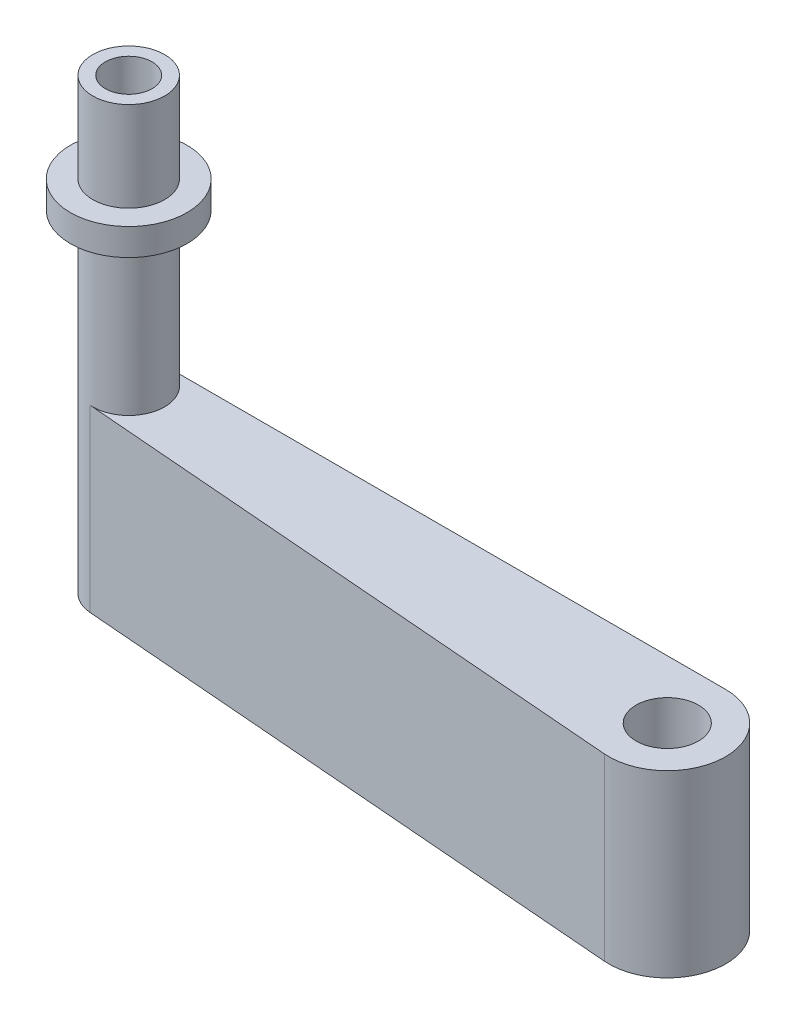
ISO-10303-21;
HEADER;
FILE_DESCRIPTION(('STEP AP214'),'2;1');
FILE_NAME('part.step','',(''),(''),'','','');
FILE_SCHEMA(('AUTOMOTIVE_DESIGN { 1 0 10303 214 1 1 1 1 }'));
ENDSEC;
DATA;
#1=APPLICATION_CONTEXT('core data for automotive mechanical design processes');
#2=APPLICATION_PROTOCOL_DEFINITION('international standard','automotive_design',2000,#1);
#3=PRODUCT_CONTEXT('',#1,'mechanical');
#4=PRODUCT('Part','Part','',(#3));
#5=PRODUCT_RELATED_PRODUCT_CATEGORY('part','',(#4));
#6=PRODUCT_DEFINITION_FORMATION('','',#4);
#7=PRODUCT_DEFINITION_CONTEXT('part definition',#1,'design');
#8=PRODUCT_DEFINITION('design','',#6,#7);
#9=PRODUCT_DEFINITION_SHAPE('','',#8);
#10=(LENGTH_UNIT() NAMED_UNIT(*) SI_UNIT(.MILLI.,.METRE.));
#11=(NAMED_UNIT(*) PLANE_ANGLE_UNIT() SI_UNIT($,.RADIAN.));
#12=(NAMED_UNIT(*) SI_UNIT($,.STERADIAN.) SOLID_ANGLE_UNIT());
#13=UNCERTAINTY_MEASURE_WITH_UNIT(LENGTH_MEASURE(1.E-05),#10,'distance_accuracy_value','');
#14=(GEOMETRIC_REPRESENTATION_CONTEXT(3) GLOBAL_UNCERTAINTY_ASSIGNED_CONTEXT((#13)) GLOBAL_UNIT_ASSIGNED_CONTEXT((#10,
#11,#12)) REPRESENTATION_CONTEXT('',''));
#15=CARTESIAN_POINT('',(0.,0.,0.));
#16=DIRECTION('',(0.,0.,1.));
#17=DIRECTION('',(1.,0.,0.));
#18=AXIS2_PLACEMENT_3D('',#15,#16,#17);
#19=CARTESIAN_POINT('',(-62.5,30.,-2.5));
#20=DIRECTION('',(0.,1.,0.));
#21=DIRECTION('',(0.,0.,1.));
#22=AXIS2_PLACEMENT_3D('',#19,#20,#21);
#23=PLANE('',#22);
#24=CARTESIAN_POINT('',(-62.5,30.,-2.5));
#25=DIRECTION('',(0.,1.,0.));
#26=DIRECTION('',(0.,0.,1.));
#27=AXIS2_PLACEMENT_3D('',#24,#25,#26);
#28=CIRCLE('',#27,6.50000000000001);
#29=CARTESIAN_POINT('',(-62.5,30.,4.00000000000001));
#30=VERTEX_POINT('',#29);
#31=EDGE_CURVE('E11',#30,#30,#28,.T.);
#32=ORIENTED_EDGE('',*,*,#31,.T.);
#33=EDGE_LOOP('',(#32));
#34=FACE_BOUND('',#33,.T.);
#35=CARTESIAN_POINT('',(-62.5,30.,-2.5));
#36=DIRECTION('',(0.,1.,0.));
#37=DIRECTION('',(0.,0.,1.));
#38=AXIS2_PLACEMENT_3D('',#35,#36,#37);
#39=CIRCLE('',#38,4.00000000000001);
#40=CARTESIAN_POINT('',(-62.5,30.,1.50000000000001));
#41=VERTEX_POINT('',#40);
#42=EDGE_CURVE('E53',#41,#41,#39,.T.);
#43=ORIENTED_EDGE('',*,*,#42,.F.);
#44=EDGE_LOOP('',(#43));
#45=FACE_BOUND('',#44,.T.);
#46=ADVANCED_FACE('F42',(#34,#45),#23,.T.);
#47=CARTESIAN_POINT('',(-62.5,27.,-2.5));
#48=DIRECTION('',(0.,1.,0.));
#49=DIRECTION('',(0.,0.,1.));
#50=AXIS2_PLACEMENT_3D('',#47,#48,#49);
#51=PLANE('',#50);
#52=CARTESIAN_POINT('',(-62.5,27.,-2.5));
#53=DIRECTION('',(0.,1.,0.));
#54=DIRECTION('',(0.,0.,1.));
#55=AXIS2_PLACEMENT_3D('',#52,#53,#54);
#56=CIRCLE('',#55,6.50000000000001);
#57=CARTESIAN_POINT('',(-62.5,27.,4.00000000000001));
#58=VERTEX_POINT('',#57);
#59=EDGE_CURVE('E46',#58,#58,#56,.T.);
#60=ORIENTED_EDGE('',*,*,#59,.F.);
#61=EDGE_LOOP('',(#60));
#62=FACE_BOUND('',#61,.T.);
#63=CARTESIAN_POINT('',(-62.5,27.,-2.5));
#64=DIRECTION('',(0.,1.,0.));
#65=DIRECTION('',(0.,0.,1.));
#66=AXIS2_PLACEMENT_3D('',#63,#64,#65);
#67=CIRCLE('',#66,4.00000000000001);
#68=CARTESIAN_POINT('',(-62.5,27.,1.50000000000001));
#69=VERTEX_POINT('',#68);
#70=EDGE_CURVE('E55',#69,#69,#67,.T.);
#71=ORIENTED_EDGE('',*,*,#70,.T.);
#72=EDGE_LOOP('',(#71));
#73=FACE_BOUND('',#72,.T.);
#74=ADVANCED_FACE('F65',(#62,#73),#51,.F.);
#75=CARTESIAN_POINT('',(-62.5,30.,-2.5));
#76=DIRECTION('',(0.,-1.,0.));
#77=DIRECTION('',(0.,0.,-1.));
#78=AXIS2_PLACEMENT_3D('',#75,#76,#77);
#79=CYLINDRICAL_SURFACE('',#78,6.50000000000001);
#80=ORIENTED_EDGE('',*,*,#31,.F.);
#81=EDGE_LOOP('',(#80));
#82=FACE_BOUND('',#81,.T.);
#83=ORIENTED_EDGE('',*,*,#59,.T.);
#84=EDGE_LOOP('',(#83));
#85=FACE_BOUND('',#84,.T.);
#86=ADVANCED_FACE('F44',(#82,#85),#79,.T.);
#87=CARTESIAN_POINT('',(-62.5,30.,-2.5));
#88=DIRECTION('',(0.,-1.,0.));
#89=DIRECTION('',(0.,0.,-1.));
#90=AXIS2_PLACEMENT_3D('',#87,#88,#89);
#91=CYLINDRICAL_SURFACE('',#90,4.00000000000001);
#92=ORIENTED_EDGE('',*,*,#42,.T.);
#93=EDGE_LOOP('',(#92));
#94=FACE_BOUND('',#93,.T.);
#95=ORIENTED_EDGE('',*,*,#70,.F.);
#96=EDGE_LOOP('',(#95));
#97=FACE_BOUND('',#96,.T.);
#98=ADVANCED_FACE('F61',(#94,#97),#91,.F.);
#99=CLOSED_SHELL('',(#46,#74,#86,#98));
#100=MANIFOLD_SOLID_BREP('B2',#99);
#101=CARTESIAN_POINT('',(0.,10.,0.));
#102=DIRECTION('',(0.,-1.,0.));
#103=DIRECTION('',(0.,0.,-1.));
#104=AXIS2_PLACEMENT_3D('',#101,#102,#103);
#105=CYLINDRICAL_SURFACE('',#104,6.5);
#106=CARTESIAN_POINT('',(0.,-10.,0.));
#107=DIRECTION('',(0.,1.,0.));
#108=DIRECTION('',(0.,0.,1.));
#109=AXIS2_PLACEMENT_3D('',#106,#107,#108);
#110=CIRCLE('',#109,6.5);
#111=CARTESIAN_POINT('',(-0.519169329073483,-10.,6.47923322683706));
#112=VERTEX_POINT('',#111);
#113=CARTESIAN_POINT('',(0.,-10.,-6.5));
#114=VERTEX_POINT('',#113);
#115=EDGE_CURVE('E171',#112,#114,#110,.T.);
#116=ORIENTED_EDGE('',*,*,#115,.T.);
#117=DIRECTION('',(0.,-1.,0.));
#118=VECTOR('',#117,1.);
#119=CARTESIAN_POINT('',(0.,10.,-6.5));
#120=LINE('',#119,#118);
#121=CARTESIAN_POINT('',(0.,10.,-6.5));
#122=VERTEX_POINT('',#121);
#123=EDGE_CURVE('E106',#122,#114,#120,.T.);
#124=ORIENTED_EDGE('',*,*,#123,.F.);
#125=CARTESIAN_POINT('',(0.,10.,0.));
#126=DIRECTION('',(0.,1.,0.));
#127=DIRECTION('',(0.,0.,1.));
#128=AXIS2_PLACEMENT_3D('',#125,#126,#127);
#129=CIRCLE('',#128,6.5);
#130=CARTESIAN_POINT('',(-0.519169329073483,10.,6.47923322683706));
#131=VERTEX_POINT('',#130);
#132=EDGE_CURVE('E159',#131,#122,#129,.T.);
#133=ORIENTED_EDGE('',*,*,#132,.F.);
#134=DIRECTION('',(0.,-1.,0.));
#135=VECTOR('',#134,1.);
#136=CARTESIAN_POINT('',(-0.519169329073483,10.,6.47923322683706));
#137=LINE('',#136,#135);
#138=EDGE_CURVE('E164',#131,#112,#137,.T.);
#139=ORIENTED_EDGE('',*,*,#138,.T.);
#140=EDGE_LOOP('',(#116,#124,#133,#139));
#141=FACE_BOUND('',#140,.T.);
#142=ADVANCED_FACE('F103',(#141),#105,.T.);
#143=CARTESIAN_POINT('',(-62.5,10.,-6.5));
#144=DIRECTION('',(0.,0.,1.));
#145=DIRECTION('',(1.,0.,0.));
#146=AXIS2_PLACEMENT_3D('',#143,#144,#145);
#147=PLANE('',#146);
#148=DIRECTION('',(-1.,0.,0.));
#149=VECTOR('',#148,1.);
#150=CARTESIAN_POINT('',(-62.5,-10.,-6.5));
#151=LINE('',#150,#149);
#152=CARTESIAN_POINT('',(-62.5,-10.,-6.5));
#153=VERTEX_POINT('',#152);
#154=EDGE_CURVE('E154',#114,#153,#151,.T.);
#155=ORIENTED_EDGE('',*,*,#154,.T.);
#156=DIRECTION('',(0.,-1.,0.));
#157=VECTOR('',#156,1.);
#158=CARTESIAN_POINT('',(-62.5,10.,-6.5));
#159=LINE('',#158,#157);
#160=CARTESIAN_POINT('',(-62.5,10.,-6.50000000000001));
#161=VERTEX_POINT('',#160);
#162=EDGE_CURVE('E152',#161,#153,#159,.T.);
#163=ORIENTED_EDGE('',*,*,#162,.F.);
#164=DIRECTION('',(-1.,0.,0.));
#165=VECTOR('',#164,1.);
#166=CARTESIAN_POINT('',(-62.5,10.,-6.5));
#167=LINE('',#166,#165);
#168=EDGE_CURVE('E150',#122,#161,#167,.T.);
#169=ORIENTED_EDGE('',*,*,#168,.F.);
#170=ORIENTED_EDGE('',*,*,#123,.T.);
#171=EDGE_LOOP('',(#155,#163,#169,#170));
#172=FACE_BOUND('',#171,.T.);
#173=ADVANCED_FACE('F153',(#172),#147,.F.);
#174=CARTESIAN_POINT('',(-62.5,10.,-2.5));
#175=DIRECTION('',(0.,-1.,0.));
#176=DIRECTION('',(0.,0.,-1.));
#177=AXIS2_PLACEMENT_3D('',#174,#175,#176);
#178=CYLINDRICAL_SURFACE('',#177,4.);
#179=CARTESIAN_POINT('',(-62.5,-10.,-2.5));
#180=DIRECTION('',(0.,1.,0.));
#181=DIRECTION('',(0.,0.,1.));
#182=AXIS2_PLACEMENT_3D('',#179,#180,#181);
#183=CIRCLE('',#182,4.);
#184=CARTESIAN_POINT('',(-62.8194888178914,-10.,1.48722044728435));
#185=VERTEX_POINT('',#184);
#186=EDGE_CURVE('E138',#153,#185,#183,.T.);
#187=ORIENTED_EDGE('',*,*,#186,.T.);
#188=DIRECTION('',(0.,-1.,0.));
#189=VECTOR('',#188,1.);
#190=CARTESIAN_POINT('',(-62.8194888178914,10.,1.48722044728435));
#191=LINE('',#190,#189);
#192=CARTESIAN_POINT('',(-62.8194888178914,10.,1.48722044728435));
#193=VERTEX_POINT('',#192);
#194=EDGE_CURVE('E155',#193,#185,#191,.T.);
#195=ORIENTED_EDGE('',*,*,#194,.F.);
#196=CARTESIAN_POINT('',(-62.5,10.,-2.5));
#197=DIRECTION('',(0.,1.,0.));
#198=DIRECTION('',(0.,0.,1.));
#199=AXIS2_PLACEMENT_3D('',#196,#197,#198);
#200=CIRCLE('',#199,4.00000000000001);
#201=EDGE_CURVE('E40',#193,#161,#200,.T.);
#202=ORIENTED_EDGE('',*,*,#201,.T.);
#203=ORIENTED_EDGE('',*,*,#162,.T.);
#204=EDGE_LOOP('',(#187,#195,#202,#203));
#205=FACE_BOUND('',#204,.T.);
#206=CARTESIAN_POINT('',(-62.5,40.,-2.5));
#207=DIRECTION('',(0.,1.,0.));
#208=DIRECTION('',(0.,0.,1.));
#209=AXIS2_PLACEMENT_3D('',#206,#207,#208);
#210=CIRCLE('',#209,4.00000000000001);
#211=CARTESIAN_POINT('',(-62.5,40.,1.50000000000001));
#212=VERTEX_POINT('',#211);
#213=EDGE_CURVE('E181',#212,#212,#210,.T.);
#214=ORIENTED_EDGE('',*,*,#213,.F.);
#215=EDGE_LOOP('',(#214));
#216=FACE_BOUND('',#215,.T.);
#217=ADVANCED_FACE('F162',(#205,#216),#178,.T.);
#218=CARTESIAN_POINT('',(-62.8194888178914,10.,1.48722044728435));
#219=DIRECTION('',(0.0798722044728435,0.,-0.996805111821086));
#220=DIRECTION('',(-0.996805111821086,0.,-0.0798722044728435));
#221=AXIS2_PLACEMENT_3D('',#218,#219,#220);
#222=PLANE('',#221);
#223=DIRECTION('',(0.996805111821086,0.,0.0798722044728435));
#224=VECTOR('',#223,1.);
#225=CARTESIAN_POINT('',(-62.8194888178914,-10.,1.48722044728435));
#226=LINE('',#225,#224);
#227=EDGE_CURVE('E143',#185,#112,#226,.T.);
#228=ORIENTED_EDGE('',*,*,#227,.T.);
#229=ORIENTED_EDGE('',*,*,#138,.F.);
#230=DIRECTION('',(0.996805111821086,0.,0.0798722044728435));
#231=VECTOR('',#230,1.);
#232=CARTESIAN_POINT('',(-62.8194888178914,10.,1.48722044728435));
#233=LINE('',#232,#231);
#234=EDGE_CURVE('E120',#193,#131,#233,.T.);
#235=ORIENTED_EDGE('',*,*,#234,.F.);
#236=ORIENTED_EDGE('',*,*,#194,.T.);
#237=EDGE_LOOP('',(#228,#229,#235,#236));
#238=FACE_BOUND('',#237,.T.);
#239=ADVANCED_FACE('F166',(#238),#222,.F.);
#240=CARTESIAN_POINT('',(0.,10.,0.));
#241=DIRECTION('',(0.,1.,0.));
#242=DIRECTION('',(0.,0.,1.));
#243=AXIS2_PLACEMENT_3D('',#240,#241,#242);
#244=PLANE('',#243);
#245=ORIENTED_EDGE('',*,*,#201,.F.);
#246=ORIENTED_EDGE('',*,*,#234,.T.);
#247=ORIENTED_EDGE('',*,*,#132,.T.);
#248=ORIENTED_EDGE('',*,*,#168,.T.);
#249=EDGE_LOOP('',(#245,#246,#247,#248));
#250=FACE_BOUND('',#249,.T.);
#251=CARTESIAN_POINT('',(0.,10.,0.));
#252=DIRECTION('',(0.,1.,0.));
#253=DIRECTION('',(0.,0.,1.));
#254=AXIS2_PLACEMENT_3D('',#251,#252,#253);
#255=CIRCLE('',#254,3.475);
#256=CARTESIAN_POINT('',(0.,10.,3.475));
#257=VERTEX_POINT('',#256);
#258=EDGE_CURVE('E178',#257,#257,#255,.T.);
#259=ORIENTED_EDGE('',*,*,#258,.F.);
#260=EDGE_LOOP('',(#259));
#261=FACE_BOUND('',#260,.T.);
#262=ADVANCED_FACE('F156',(#250,#261),#244,.T.);
#263=CARTESIAN_POINT('',(0.,-10.,0.));
#264=DIRECTION('',(0.,1.,0.));
#265=DIRECTION('',(0.,0.,1.));
#266=AXIS2_PLACEMENT_3D('',#263,#264,#265);
#267=PLANE('',#266);
#268=CARTESIAN_POINT('',(0.,-10.,0.));
#269=DIRECTION('',(0.,1.,0.));
#270=DIRECTION('',(0.,0.,1.));
#271=AXIS2_PLACEMENT_3D('',#268,#269,#270);
#272=CIRCLE('',#271,3.475);
#273=CARTESIAN_POINT('',(0.,-10.,3.475));
#274=VERTEX_POINT('',#273);
#275=EDGE_CURVE('E174',#274,#274,#272,.T.);
#276=ORIENTED_EDGE('',*,*,#275,.T.);
#277=EDGE_LOOP('',(#276));
#278=FACE_BOUND('',#277,.T.);
#279=ORIENTED_EDGE('',*,*,#115,.F.);
#280=ORIENTED_EDGE('',*,*,#227,.F.);
#281=ORIENTED_EDGE('',*,*,#186,.F.);
#282=ORIENTED_EDGE('',*,*,#154,.F.);
#283=EDGE_LOOP('',(#279,#280,#281,#282));
#284=FACE_BOUND('',#283,.T.);
#285=ADVANCED_FACE('F220',(#278,#284),#267,.F.);
#286=CARTESIAN_POINT('',(0.,-10.,0.));
#287=DIRECTION('',(0.,1.,0.));
#288=DIRECTION('',(0.,0.,1.));
#289=AXIS2_PLACEMENT_3D('',#286,#287,#288);
#290=CYLINDRICAL_SURFACE('',#289,3.475);
#291=ORIENTED_EDGE('',*,*,#275,.F.);
#292=EDGE_LOOP('',(#291));
#293=FACE_BOUND('',#292,.T.);
#294=ORIENTED_EDGE('',*,*,#258,.T.);
#295=EDGE_LOOP('',(#294));
#296=FACE_BOUND('',#295,.T.);
#297=ADVANCED_FACE('F204',(#293,#296),#290,.F.);
#298=CARTESIAN_POINT('',(-62.5,40.,-2.5));
#299=DIRECTION('',(0.,1.,0.));
#300=DIRECTION('',(0.,0.,1.));
#301=AXIS2_PLACEMENT_3D('',#298,#299,#300);
#302=PLANE('',#301);
#303=CARTESIAN_POINT('',(-62.5,40.,-2.5));
#304=DIRECTION('',(0.,1.,0.));
#305=DIRECTION('',(0.,0.,1.));
#306=AXIS2_PLACEMENT_3D('',#303,#304,#305);
#307=CIRCLE('',#306,2.6);
#308=CARTESIAN_POINT('',(-62.5,40.,0.0999999999999968));
#309=VERTEX_POINT('',#308);
#310=EDGE_CURVE('E187',#309,#309,#307,.T.);
#311=ORIENTED_EDGE('',*,*,#310,.F.);
#312=EDGE_LOOP('',(#311));
#313=FACE_BOUND('',#312,.T.);
#314=ORIENTED_EDGE('',*,*,#213,.T.);
#315=EDGE_LOOP('',(#314));
#316=FACE_BOUND('',#315,.T.);
#317=ADVANCED_FACE('F198',(#313,#316),#302,.T.);
#318=CARTESIAN_POINT('',(-62.5,30.,-2.5));
#319=DIRECTION('',(0.,1.,0.));
#320=DIRECTION('',(0.,0.,1.));
#321=AXIS2_PLACEMENT_3D('',#318,#319,#320);
#322=CYLINDRICAL_SURFACE('',#321,2.6);
#323=CARTESIAN_POINT('',(-62.5,30.,-2.5));
#324=DIRECTION('',(0.,1.,0.));
#325=DIRECTION('',(0.,0.,1.));
#326=AXIS2_PLACEMENT_3D('',#323,#324,#325);
#327=CIRCLE('',#326,2.6);
#328=CARTESIAN_POINT('',(-62.5,30.,0.0999999999999968));
#329=VERTEX_POINT('',#328);
#330=EDGE_CURVE('E186',#329,#329,#327,.T.);
#331=ORIENTED_EDGE('',*,*,#330,.F.);
#332=EDGE_LOOP('',(#331));
#333=FACE_BOUND('',#332,.T.);
#334=ORIENTED_EDGE('',*,*,#310,.T.);
#335=EDGE_LOOP('',(#334));
#336=FACE_BOUND('',#335,.T.);
#337=ADVANCED_FACE('F195',(#333,#336),#322,.F.);
#338=CARTESIAN_POINT('',(-62.5,30.,-2.5));
#339=DIRECTION('',(0.,1.,0.));
#340=DIRECTION('',(0.,0.,1.));
#341=AXIS2_PLACEMENT_3D('',#338,#339,#340);
#342=PLANE('',#341);
#343=ORIENTED_EDGE('',*,*,#330,.T.);
#344=EDGE_LOOP('',(#343));
#345=FACE_BOUND('',#344,.T.);
#346=ADVANCED_FACE('F193',(#345),#342,.T.);
#347=CLOSED_SHELL('',(#142,#173,#217,#239,#262,#285,#297,#317,#337,#346));
#348=MANIFOLD_SOLID_BREP('B6',#347);
#349=ADVANCED_BREP_SHAPE_REPRESENTATION('',(#18,#100,#348),#14);
#350=SHAPE_DEFINITION_REPRESENTATION(#9,#349);
ENDSEC;
END-ISO-10303-21;
